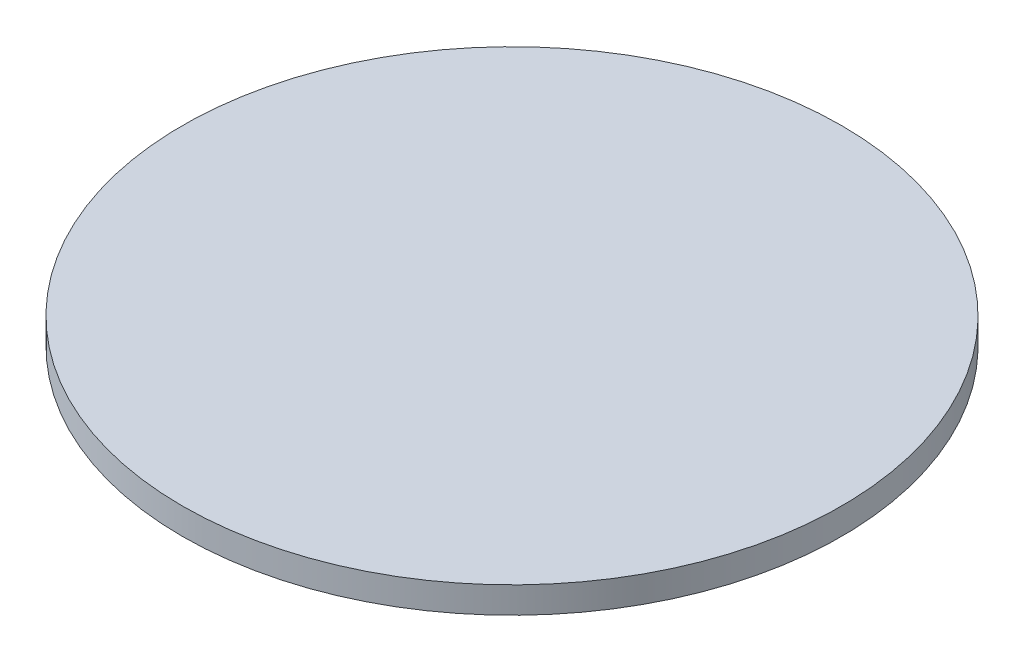
ISO-10303-21;
HEADER;
FILE_DESCRIPTION(('STEP AP214'),'2;1');
FILE_NAME('part.step','',(''),(''),'','','');
FILE_SCHEMA(('AUTOMOTIVE_DESIGN { 1 0 10303 214 1 1 1 1 }'));
ENDSEC;
DATA;
#1=APPLICATION_CONTEXT('core data for automotive mechanical design processes');
#2=APPLICATION_PROTOCOL_DEFINITION('international standard','automotive_design',2000,#1);
#3=PRODUCT_CONTEXT('',#1,'mechanical');
#4=PRODUCT('Part','Part','',(#3));
#5=PRODUCT_RELATED_PRODUCT_CATEGORY('part','',(#4));
#6=PRODUCT_DEFINITION_FORMATION('','',#4);
#7=PRODUCT_DEFINITION_CONTEXT('part definition',#1,'design');
#8=PRODUCT_DEFINITION('design','',#6,#7);
#9=PRODUCT_DEFINITION_SHAPE('','',#8);
#10=(LENGTH_UNIT() NAMED_UNIT(*) SI_UNIT(.MILLI.,.METRE.));
#11=(NAMED_UNIT(*) PLANE_ANGLE_UNIT() SI_UNIT($,.RADIAN.));
#12=(NAMED_UNIT(*) SI_UNIT($,.STERADIAN.) SOLID_ANGLE_UNIT());
#13=UNCERTAINTY_MEASURE_WITH_UNIT(LENGTH_MEASURE(1.E-05),#10,'distance_accuracy_value','');
#14=(GEOMETRIC_REPRESENTATION_CONTEXT(3) GLOBAL_UNCERTAINTY_ASSIGNED_CONTEXT((#13)) GLOBAL_UNIT_ASSIGNED_CONTEXT((#10,
#11,#12)) REPRESENTATION_CONTEXT('',''));
#15=CARTESIAN_POINT('',(0.,0.,0.));
#16=DIRECTION('',(0.,0.,1.));
#17=DIRECTION('',(1.,0.,0.));
#18=AXIS2_PLACEMENT_3D('',#15,#16,#17);
#19=CARTESIAN_POINT('',(0.,2.,0.));
#20=DIRECTION('',(0.,-1.,0.));
#21=DIRECTION('',(0.,0.,-1.));
#22=AXIS2_PLACEMENT_3D('',#19,#20,#21);
#23=CYLINDRICAL_SURFACE('',#22,25.);
#24=CARTESIAN_POINT('',(0.,2.,0.));
#25=DIRECTION('',(0.,1.,0.));
#26=DIRECTION('',(0.,0.,1.));
#27=AXIS2_PLACEMENT_3D('',#24,#25,#26);
#28=CIRCLE('',#27,25.);
#29=CARTESIAN_POINT('',(0.,2.,25.));
#30=VERTEX_POINT('',#29);
#31=EDGE_CURVE('E10',#30,#30,#28,.T.);
#32=ORIENTED_EDGE('',*,*,#31,.F.);
#33=EDGE_LOOP('',(#32));
#34=FACE_BOUND('',#33,.T.);
#35=CARTESIAN_POINT('',(0.,0.,0.));
#36=DIRECTION('',(0.,1.,0.));
#37=DIRECTION('',(0.,0.,1.));
#38=AXIS2_PLACEMENT_3D('',#35,#36,#37);
#39=CIRCLE('',#38,25.);
#40=CARTESIAN_POINT('',(0.,0.,25.));
#41=VERTEX_POINT('',#40);
#42=EDGE_CURVE('E33',#41,#41,#39,.T.);
#43=ORIENTED_EDGE('',*,*,#42,.T.);
#44=EDGE_LOOP('',(#43));
#45=FACE_BOUND('',#44,.T.);
#46=ADVANCED_FACE('F30',(#34,#45),#23,.T.);
#47=CARTESIAN_POINT('',(0.,2.,0.));
#48=DIRECTION('',(0.,1.,0.));
#49=DIRECTION('',(0.,0.,1.));
#50=AXIS2_PLACEMENT_3D('',#47,#48,#49);
#51=PLANE('',#50);
#52=ORIENTED_EDGE('',*,*,#31,.T.);
#53=EDGE_LOOP('',(#52));
#54=FACE_BOUND('',#53,.T.);
#55=ADVANCED_FACE('F45',(#54),#51,.T.);
#56=CARTESIAN_POINT('',(0.,0.,0.));
#57=DIRECTION('',(0.,1.,0.));
#58=DIRECTION('',(0.,0.,1.));
#59=AXIS2_PLACEMENT_3D('',#56,#57,#58);
#60=PLANE('',#59);
#61=ORIENTED_EDGE('',*,*,#42,.F.);
#62=EDGE_LOOP('',(#61));
#63=FACE_BOUND('',#62,.T.);
#64=ADVANCED_FACE('F43',(#63),#60,.F.);
#65=CLOSED_SHELL('',(#46,#55,#64));
#66=MANIFOLD_SOLID_BREP('B2',#65);
#67=ADVANCED_BREP_SHAPE_REPRESENTATION('',(#18,#66),#14);
#68=SHAPE_DEFINITION_REPRESENTATION(#9,#67);
ENDSEC;
END-ISO-10303-21;
